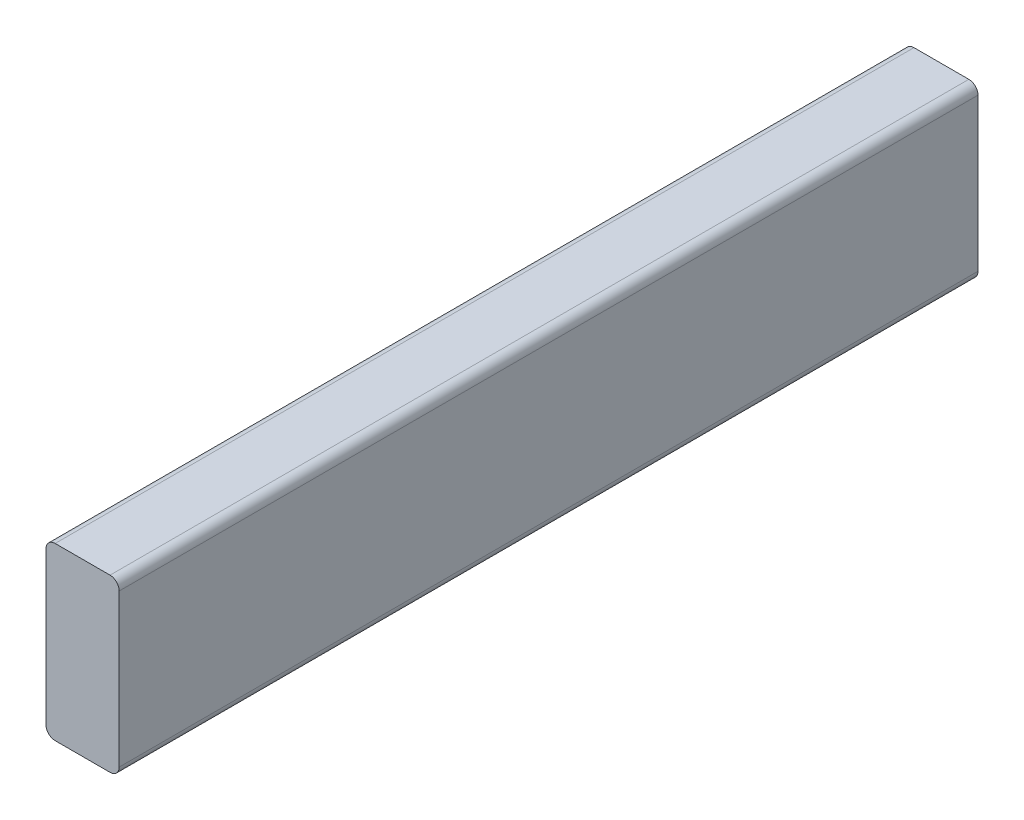
ISO-10303-21;
HEADER;
FILE_DESCRIPTION(('STEP AP214'),'2;1');
FILE_NAME('part.step','',(''),(''),'','','');
FILE_SCHEMA(('AUTOMOTIVE_DESIGN { 1 0 10303 214 1 1 1 1 }'));
ENDSEC;
DATA;
#1=APPLICATION_CONTEXT('core data for automotive mechanical design processes');
#2=APPLICATION_PROTOCOL_DEFINITION('international standard','automotive_design',2000,#1);
#3=PRODUCT_CONTEXT('',#1,'mechanical');
#4=PRODUCT('Part','Part','',(#3));
#5=PRODUCT_RELATED_PRODUCT_CATEGORY('part','',(#4));
#6=PRODUCT_DEFINITION_FORMATION('','',#4);
#7=PRODUCT_DEFINITION_CONTEXT('part definition',#1,'design');
#8=PRODUCT_DEFINITION('design','',#6,#7);
#9=PRODUCT_DEFINITION_SHAPE('','',#8);
#10=(LENGTH_UNIT() NAMED_UNIT(*) SI_UNIT(.MILLI.,.METRE.));
#11=(NAMED_UNIT(*) PLANE_ANGLE_UNIT() SI_UNIT($,.RADIAN.));
#12=(NAMED_UNIT(*) SI_UNIT($,.STERADIAN.) SOLID_ANGLE_UNIT());
#13=UNCERTAINTY_MEASURE_WITH_UNIT(LENGTH_MEASURE(1.E-05),#10,'distance_accuracy_value','');
#14=(GEOMETRIC_REPRESENTATION_CONTEXT(3) GLOBAL_UNCERTAINTY_ASSIGNED_CONTEXT((#13)) GLOBAL_UNIT_ASSIGNED_CONTEXT((#10,
#11,#12)) REPRESENTATION_CONTEXT('',''));
#15=CARTESIAN_POINT('',(0.,0.,0.));
#16=DIRECTION('',(0.,0.,1.));
#17=DIRECTION('',(1.,0.,0.));
#18=AXIS2_PLACEMENT_3D('',#15,#16,#17);
#19=CARTESIAN_POINT('',(0.,0.,0.));
#20=DIRECTION('',(0.,0.,1.));
#21=DIRECTION('',(1.,0.,0.));
#22=AXIS2_PLACEMENT_3D('',#19,#20,#21);
#23=PLANE('',#22);
#24=DIRECTION('',(0.,-1.,0.));
#25=VECTOR('',#24,1.);
#26=CARTESIAN_POINT('',(-204.932187925,440.550363877538,0.));
#27=LINE('',#26,#25);
#28=CARTESIAN_POINT('',(-204.932187925,435.787863877538,0.));
#29=VERTEX_POINT('',#28);
#30=CARTESIAN_POINT('',(-204.932187925,356.412863877538,0.));
#31=VERTEX_POINT('',#30);
#32=EDGE_CURVE('E112',#29,#31,#27,.T.);
#33=ORIENTED_EDGE('',*,*,#32,.T.);
#34=CARTESIAN_POINT('',(-200.169687925,356.412863877538,0.));
#35=DIRECTION('',(0.,0.,1.));
#36=DIRECTION('',(1.,0.,0.));
#37=AXIS2_PLACEMENT_3D('',#34,#35,#36);
#38=CIRCLE('',#37,4.7625);
#39=CARTESIAN_POINT('',(-200.169687925,351.650363877538,0.));
#40=VERTEX_POINT('',#39);
#41=EDGE_CURVE('E187',#31,#40,#38,.T.);
#42=ORIENTED_EDGE('',*,*,#41,.T.);
#43=DIRECTION('',(1.,0.,0.));
#44=VECTOR('',#43,1.);
#45=CARTESIAN_POINT('',(-204.932187925,351.650363877538,0.));
#46=LINE('',#45,#44);
#47=CARTESIAN_POINT('',(-171.594687925,351.650363877538,0.));
#48=VERTEX_POINT('',#47);
#49=EDGE_CURVE('E169',#40,#48,#46,.T.);
#50=ORIENTED_EDGE('',*,*,#49,.T.);
#51=CARTESIAN_POINT('',(-171.594687925,356.412863877538,0.));
#52=DIRECTION('',(0.,0.,1.));
#53=DIRECTION('',(1.,0.,0.));
#54=AXIS2_PLACEMENT_3D('',#51,#52,#53);
#55=CIRCLE('',#54,4.7625);
#56=CARTESIAN_POINT('',(-166.832187925,356.412863877538,0.));
#57=VERTEX_POINT('',#56);
#58=EDGE_CURVE('E167',#48,#57,#55,.T.);
#59=ORIENTED_EDGE('',*,*,#58,.T.);
#60=DIRECTION('',(0.,1.,0.));
#61=VECTOR('',#60,1.);
#62=CARTESIAN_POINT('',(-166.832187925,440.550363877538,0.));
#63=LINE('',#62,#61);
#64=CARTESIAN_POINT('',(-166.832187925,435.787863877538,0.));
#65=VERTEX_POINT('',#64);
#66=EDGE_CURVE('E164',#57,#65,#63,.T.);
#67=ORIENTED_EDGE('',*,*,#66,.T.);
#68=CARTESIAN_POINT('',(-171.594687925,435.787863877538,0.));
#69=DIRECTION('',(0.,0.,1.));
#70=DIRECTION('',(1.,0.,0.));
#71=AXIS2_PLACEMENT_3D('',#68,#69,#70);
#72=CIRCLE('',#71,4.7625);
#73=CARTESIAN_POINT('',(-171.594687925,440.550363877538,0.));
#74=VERTEX_POINT('',#73);
#75=EDGE_CURVE('E161',#65,#74,#72,.T.);
#76=ORIENTED_EDGE('',*,*,#75,.T.);
#77=DIRECTION('',(-1.,0.,0.));
#78=VECTOR('',#77,1.);
#79=CARTESIAN_POINT('',(-204.932187925,440.550363877538,0.));
#80=LINE('',#79,#78);
#81=CARTESIAN_POINT('',(-200.169687925,440.550363877538,0.));
#82=VERTEX_POINT('',#81);
#83=EDGE_CURVE('E117',#74,#82,#80,.T.);
#84=ORIENTED_EDGE('',*,*,#83,.T.);
#85=CARTESIAN_POINT('',(-200.169687925,435.787863877538,0.));
#86=DIRECTION('',(0.,0.,1.));
#87=DIRECTION('',(1.,0.,0.));
#88=AXIS2_PLACEMENT_3D('',#85,#86,#87);
#89=CIRCLE('',#88,4.7625);
#90=EDGE_CURVE('E182',#82,#29,#89,.T.);
#91=ORIENTED_EDGE('',*,*,#90,.T.);
#92=EDGE_LOOP('',(#33,#42,#50,#59,#67,#76,#84,#91));
#93=FACE_BOUND('',#92,.T.);
#94=ADVANCED_FACE('F36',(#93),#23,.T.);
#95=CARTESIAN_POINT('',(-204.932187925,351.650363877538,-543.696818444492));
#96=DIRECTION('',(0.,-1.,0.));
#97=DIRECTION('',(0.,0.,-1.));
#98=AXIS2_PLACEMENT_3D('',#95,#96,#97);
#99=PLANE('',#98);
#100=ORIENTED_EDGE('',*,*,#49,.F.);
#101=DIRECTION('',(0.,0.,1.));
#102=VECTOR('',#101,1.);
#103=CARTESIAN_POINT('',(-200.169687925,351.650363877538,-543.696818444492));
#104=LINE('',#103,#102);
#105=CARTESIAN_POINT('',(-200.169687925,351.650363877538,-446.97650000001));
#106=VERTEX_POINT('',#105);
#107=EDGE_CURVE('E137',#40,#106,#104,.F.);
#108=ORIENTED_EDGE('',*,*,#107,.T.);
#109=DIRECTION('',(1.,0.,0.));
#110=VECTOR('',#109,1.);
#111=CARTESIAN_POINT('',(-204.932187925,351.650363877538,-446.97650000001));
#112=LINE('',#111,#110);
#113=CARTESIAN_POINT('',(-171.594687925,351.650363877538,-446.97650000001));
#114=VERTEX_POINT('',#113);
#115=EDGE_CURVE('E126',#106,#114,#112,.T.);
#116=ORIENTED_EDGE('',*,*,#115,.T.);
#117=DIRECTION('',(0.,0.,1.));
#118=VECTOR('',#117,1.);
#119=CARTESIAN_POINT('',(-171.594687925,351.650363877538,-543.696818444492));
#120=LINE('',#119,#118);
#121=EDGE_CURVE('E190',#114,#48,#120,.T.);
#122=ORIENTED_EDGE('',*,*,#121,.T.);
#123=EDGE_LOOP('',(#100,#108,#116,#122));
#124=FACE_BOUND('',#123,.T.);
#125=ADVANCED_FACE('F199',(#124),#99,.T.);
#126=CARTESIAN_POINT('',(-166.832187925,440.550363877538,-543.696818444492));
#127=DIRECTION('',(1.,0.,0.));
#128=DIRECTION('',(0.,0.,-1.));
#129=AXIS2_PLACEMENT_3D('',#126,#127,#128);
#130=PLANE('',#129);
#131=ORIENTED_EDGE('',*,*,#66,.F.);
#132=DIRECTION('',(0.,0.,1.));
#133=VECTOR('',#132,1.);
#134=CARTESIAN_POINT('',(-166.832187925,356.412863877538,-543.696818444492));
#135=LINE('',#134,#133);
#136=CARTESIAN_POINT('',(-166.832187925,356.412863877538,-446.97650000001));
#137=VERTEX_POINT('',#136);
#138=EDGE_CURVE('E59',#57,#137,#135,.F.);
#139=ORIENTED_EDGE('',*,*,#138,.T.);
#140=DIRECTION('',(0.,1.,0.));
#141=VECTOR('',#140,1.);
#142=CARTESIAN_POINT('',(-166.832187925,440.550363877538,-446.97650000001));
#143=LINE('',#142,#141);
#144=CARTESIAN_POINT('',(-166.832187925,435.787863877538,-446.97650000001));
#145=VERTEX_POINT('',#144);
#146=EDGE_CURVE('E158',#137,#145,#143,.T.);
#147=ORIENTED_EDGE('',*,*,#146,.T.);
#148=DIRECTION('',(0.,0.,1.));
#149=VECTOR('',#148,1.);
#150=CARTESIAN_POINT('',(-166.832187925,435.787863877538,-543.696818444492));
#151=LINE('',#150,#149);
#152=EDGE_CURVE('E143',#145,#65,#151,.T.);
#153=ORIENTED_EDGE('',*,*,#152,.T.);
#154=EDGE_LOOP('',(#131,#139,#147,#153));
#155=FACE_BOUND('',#154,.T.);
#156=ADVANCED_FACE('F163',(#155),#130,.T.);
#157=CARTESIAN_POINT('',(-204.932187925,440.550363877538,-543.696818444492));
#158=DIRECTION('',(0.,1.,0.));
#159=DIRECTION('',(0.,0.,1.));
#160=AXIS2_PLACEMENT_3D('',#157,#158,#159);
#161=PLANE('',#160);
#162=DIRECTION('',(-1.,0.,0.));
#163=VECTOR('',#162,1.);
#164=CARTESIAN_POINT('',(-204.932187925,440.550363877538,-446.97650000001));
#165=LINE('',#164,#163);
#166=CARTESIAN_POINT('',(-171.594687925,440.550363877538,-446.97650000001));
#167=VERTEX_POINT('',#166);
#168=CARTESIAN_POINT('',(-200.169687925,440.550363877538,-446.97650000001));
#169=VERTEX_POINT('',#168);
#170=EDGE_CURVE('E154',#167,#169,#165,.T.);
#171=ORIENTED_EDGE('',*,*,#170,.T.);
#172=DIRECTION('',(0.,0.,1.));
#173=VECTOR('',#172,1.);
#174=CARTESIAN_POINT('',(-200.169687925,440.550363877538,-543.696818444492));
#175=LINE('',#174,#173);
#176=EDGE_CURVE('E11',#169,#82,#175,.T.);
#177=ORIENTED_EDGE('',*,*,#176,.T.);
#178=ORIENTED_EDGE('',*,*,#83,.F.);
#179=DIRECTION('',(0.,0.,1.));
#180=VECTOR('',#179,1.);
#181=CARTESIAN_POINT('',(-171.594687925,440.550363877538,-543.696818444492));
#182=LINE('',#181,#180);
#183=EDGE_CURVE('E45',#74,#167,#182,.F.);
#184=ORIENTED_EDGE('',*,*,#183,.T.);
#185=EDGE_LOOP('',(#171,#177,#178,#184));
#186=FACE_BOUND('',#185,.T.);
#187=ADVANCED_FACE('F153',(#186),#161,.T.);
#188=CARTESIAN_POINT('',(-204.932187925,440.550363877538,-543.696818444492));
#189=DIRECTION('',(-1.,0.,0.));
#190=DIRECTION('',(0.,0.,1.));
#191=AXIS2_PLACEMENT_3D('',#188,#189,#190);
#192=PLANE('',#191);
#193=DIRECTION('',(0.,-1.,0.));
#194=VECTOR('',#193,1.);
#195=CARTESIAN_POINT('',(-204.932187925,440.550363877538,-446.97650000002));
#196=LINE('',#195,#194);
#197=CARTESIAN_POINT('',(-204.932187925,435.787863877538,-446.97650000002));
#198=VERTEX_POINT('',#197);
#199=CARTESIAN_POINT('',(-204.932187925,356.412863877538,-446.97650000002));
#200=VERTEX_POINT('',#199);
#201=EDGE_CURVE('E109',#198,#200,#196,.T.);
#202=ORIENTED_EDGE('',*,*,#201,.T.);
#203=DIRECTION('',(0.,0.,1.));
#204=VECTOR('',#203,1.);
#205=CARTESIAN_POINT('',(-204.932187925,356.412863877538,-543.696818444492));
#206=LINE('',#205,#204);
#207=EDGE_CURVE('E116',#200,#31,#206,.T.);
#208=ORIENTED_EDGE('',*,*,#207,.T.);
#209=ORIENTED_EDGE('',*,*,#32,.F.);
#210=DIRECTION('',(0.,0.,1.));
#211=VECTOR('',#210,1.);
#212=CARTESIAN_POINT('',(-204.932187925,435.787863877538,-543.696818444492));
#213=LINE('',#212,#211);
#214=EDGE_CURVE('E105',#29,#198,#213,.F.);
#215=ORIENTED_EDGE('',*,*,#214,.T.);
#216=EDGE_LOOP('',(#202,#208,#209,#215));
#217=FACE_BOUND('',#216,.T.);
#218=ADVANCED_FACE('F107',(#217),#192,.T.);
#219=CARTESIAN_POINT('',(-204.932187925,1473.2,-446.976500000021));
#220=DIRECTION('',(0.,0.,-1.));
#221=DIRECTION('',(0.,-1.,0.));
#222=AXIS2_PLACEMENT_3D('',#219,#220,#221);
#223=PLANE('',#222);
#224=ORIENTED_EDGE('',*,*,#115,.F.);
#225=CARTESIAN_POINT('',(-200.169687925,356.412863877538,-446.97650000002));
#226=DIRECTION('',(0.,0.,-1.));
#227=DIRECTION('',(0.,1.,0.));
#228=AXIS2_PLACEMENT_3D('',#225,#226,#227);
#229=CIRCLE('',#228,4.7625);
#230=EDGE_CURVE('E124',#106,#200,#229,.T.);
#231=ORIENTED_EDGE('',*,*,#230,.T.);
#232=ORIENTED_EDGE('',*,*,#201,.F.);
#233=CARTESIAN_POINT('',(-200.169687925,435.787863877538,-446.97650000002));
#234=DIRECTION('',(0.,0.,-1.));
#235=DIRECTION('',(0.,1.,0.));
#236=AXIS2_PLACEMENT_3D('',#233,#234,#235);
#237=CIRCLE('',#236,4.7625);
#238=EDGE_CURVE('E121',#198,#169,#237,.T.);
#239=ORIENTED_EDGE('',*,*,#238,.T.);
#240=ORIENTED_EDGE('',*,*,#170,.F.);
#241=CARTESIAN_POINT('',(-171.594687925,435.787863877538,-446.97650000002));
#242=DIRECTION('',(0.,0.,-1.));
#243=DIRECTION('',(0.,1.,0.));
#244=AXIS2_PLACEMENT_3D('',#241,#242,#243);
#245=CIRCLE('',#244,4.7625);
#246=EDGE_CURVE('E52',#167,#145,#245,.T.);
#247=ORIENTED_EDGE('',*,*,#246,.T.);
#248=ORIENTED_EDGE('',*,*,#146,.F.);
#249=CARTESIAN_POINT('',(-171.594687925,356.412863877538,-446.97650000002));
#250=DIRECTION('',(0.,0.,-1.));
#251=DIRECTION('',(0.,1.,0.));
#252=AXIS2_PLACEMENT_3D('',#249,#250,#251);
#253=CIRCLE('',#252,4.7625);
#254=EDGE_CURVE('E131',#137,#114,#253,.T.);
#255=ORIENTED_EDGE('',*,*,#254,.T.);
#256=EDGE_LOOP('',(#224,#231,#232,#239,#240,#247,#248,#255));
#257=FACE_BOUND('',#256,.T.);
#258=ADVANCED_FACE('F120',(#257),#223,.T.);
#259=CARTESIAN_POINT('',(-200.169687925,356.412863877538,-543.696818444492));
#260=DIRECTION('',(0.,0.,1.));
#261=DIRECTION('',(1.,0.,0.));
#262=AXIS2_PLACEMENT_3D('',#259,#260,#261);
#263=CYLINDRICAL_SURFACE('',#262,4.7625);
#264=ORIENTED_EDGE('',*,*,#230,.F.);
#265=ORIENTED_EDGE('',*,*,#107,.F.);
#266=ORIENTED_EDGE('',*,*,#41,.F.);
#267=ORIENTED_EDGE('',*,*,#207,.F.);
#268=EDGE_LOOP('',(#264,#265,#266,#267));
#269=FACE_BOUND('',#268,.T.);
#270=ADVANCED_FACE('F205',(#269),#263,.T.);
#271=CARTESIAN_POINT('',(-171.594687925,356.412863877538,-543.696818444492));
#272=DIRECTION('',(0.,0.,1.));
#273=DIRECTION('',(1.,0.,0.));
#274=AXIS2_PLACEMENT_3D('',#271,#272,#273);
#275=CYLINDRICAL_SURFACE('',#274,4.7625);
#276=ORIENTED_EDGE('',*,*,#254,.F.);
#277=ORIENTED_EDGE('',*,*,#138,.F.);
#278=ORIENTED_EDGE('',*,*,#58,.F.);
#279=ORIENTED_EDGE('',*,*,#121,.F.);
#280=EDGE_LOOP('',(#276,#277,#278,#279));
#281=FACE_BOUND('',#280,.T.);
#282=ADVANCED_FACE('F216',(#281),#275,.T.);
#283=CARTESIAN_POINT('',(-200.169687925,435.787863877538,-543.696818444492));
#284=DIRECTION('',(0.,0.,1.));
#285=DIRECTION('',(1.,0.,0.));
#286=AXIS2_PLACEMENT_3D('',#283,#284,#285);
#287=CYLINDRICAL_SURFACE('',#286,4.7625);
#288=ORIENTED_EDGE('',*,*,#238,.F.);
#289=ORIENTED_EDGE('',*,*,#214,.F.);
#290=ORIENTED_EDGE('',*,*,#90,.F.);
#291=ORIENTED_EDGE('',*,*,#176,.F.);
#292=EDGE_LOOP('',(#288,#289,#290,#291));
#293=FACE_BOUND('',#292,.T.);
#294=ADVANCED_FACE('F129',(#293),#287,.T.);
#295=CARTESIAN_POINT('',(-171.594687925,435.787863877538,-543.696818444492));
#296=DIRECTION('',(0.,0.,1.));
#297=DIRECTION('',(1.,0.,0.));
#298=AXIS2_PLACEMENT_3D('',#295,#296,#297);
#299=CYLINDRICAL_SURFACE('',#298,4.7625);
#300=ORIENTED_EDGE('',*,*,#246,.F.);
#301=ORIENTED_EDGE('',*,*,#183,.F.);
#302=ORIENTED_EDGE('',*,*,#75,.F.);
#303=ORIENTED_EDGE('',*,*,#152,.F.);
#304=EDGE_LOOP('',(#300,#301,#302,#303));
#305=FACE_BOUND('',#304,.T.);
#306=ADVANCED_FACE('F38',(#305),#299,.T.);
#307=CLOSED_SHELL('',(#94,#125,#156,#187,#218,#258,#270,#282,#294,#306));
#308=MANIFOLD_SOLID_BREP('B2',#307);
#309=ADVANCED_BREP_SHAPE_REPRESENTATION('',(#18,#308),#14);
#310=SHAPE_DEFINITION_REPRESENTATION(#9,#309);
ENDSEC;
END-ISO-10303-21;
